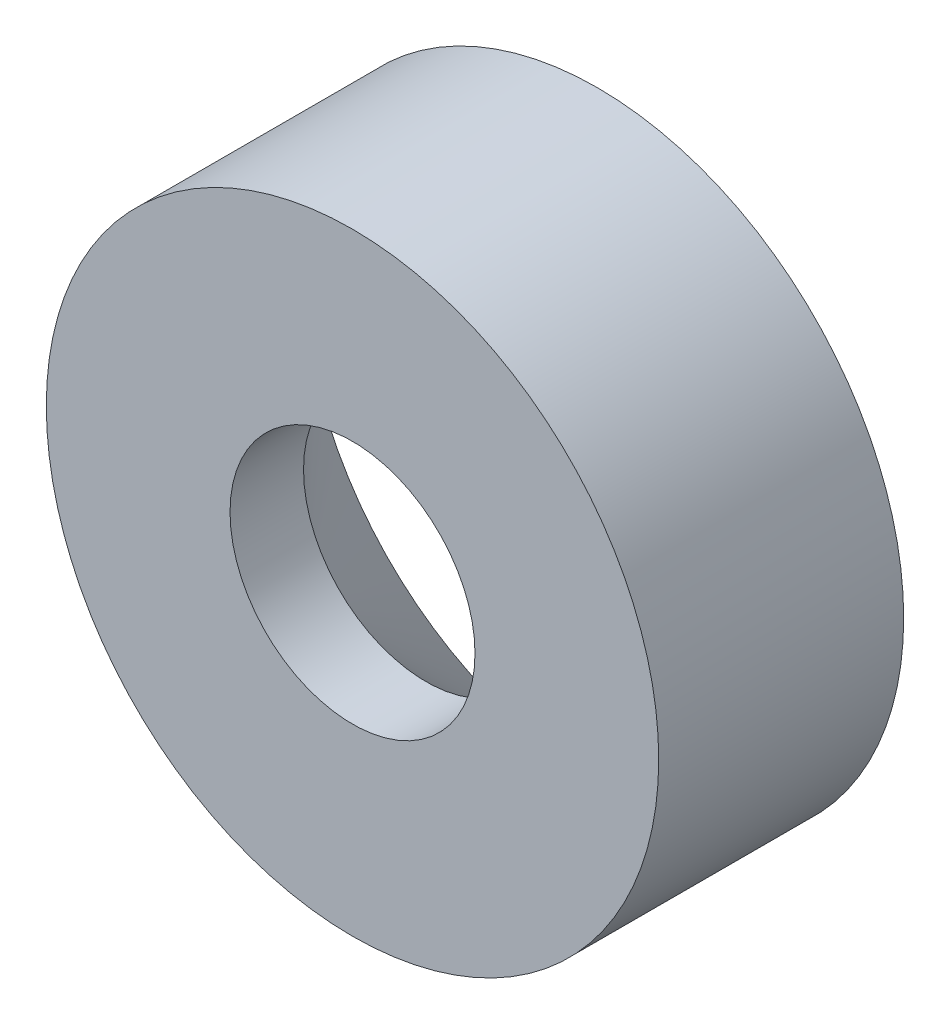
ISO-10303-21;
HEADER;
FILE_DESCRIPTION(('STEP AP214'),'2;1');
FILE_NAME('part.step','',(''),(''),'','','');
FILE_SCHEMA(('AUTOMOTIVE_DESIGN { 1 0 10303 214 1 1 1 1 }'));
ENDSEC;
DATA;
#1=APPLICATION_CONTEXT('core data for automotive mechanical design processes');
#2=APPLICATION_PROTOCOL_DEFINITION('international standard','automotive_design',2000,#1);
#3=PRODUCT_CONTEXT('',#1,'mechanical');
#4=PRODUCT('Part','Part','',(#3));
#5=PRODUCT_RELATED_PRODUCT_CATEGORY('part','',(#4));
#6=PRODUCT_DEFINITION_FORMATION('','',#4);
#7=PRODUCT_DEFINITION_CONTEXT('part definition',#1,'design');
#8=PRODUCT_DEFINITION('design','',#6,#7);
#9=PRODUCT_DEFINITION_SHAPE('','',#8);
#10=(LENGTH_UNIT() NAMED_UNIT(*) SI_UNIT(.MILLI.,.METRE.));
#11=(NAMED_UNIT(*) PLANE_ANGLE_UNIT() SI_UNIT($,.RADIAN.));
#12=(NAMED_UNIT(*) SI_UNIT($,.STERADIAN.) SOLID_ANGLE_UNIT());
#13=UNCERTAINTY_MEASURE_WITH_UNIT(LENGTH_MEASURE(1.E-05),#10,'distance_accuracy_value','');
#14=(GEOMETRIC_REPRESENTATION_CONTEXT(3) GLOBAL_UNCERTAINTY_ASSIGNED_CONTEXT((#13)) GLOBAL_UNIT_ASSIGNED_CONTEXT((#10,
#11,#12)) REPRESENTATION_CONTEXT('',''));
#15=CARTESIAN_POINT('',(0.,0.,0.));
#16=DIRECTION('',(0.,0.,1.));
#17=DIRECTION('',(1.,0.,0.));
#18=AXIS2_PLACEMENT_3D('',#15,#16,#17);
#19=CARTESIAN_POINT('',(0.,0.,10.));
#20=DIRECTION('',(0.,0.,-1.));
#21=DIRECTION('',(-1.,0.,0.));
#22=AXIS2_PLACEMENT_3D('',#19,#20,#21);
#23=CYLINDRICAL_SURFACE('',#22,12.5);
#24=CARTESIAN_POINT('',(0.,0.,10.));
#25=DIRECTION('',(0.,0.,1.));
#26=DIRECTION('',(1.,0.,0.));
#27=AXIS2_PLACEMENT_3D('',#24,#25,#26);
#28=CIRCLE('',#27,12.5);
#29=CARTESIAN_POINT('',(12.5,0.,10.));
#30=VERTEX_POINT('',#29);
#31=EDGE_CURVE('E41',#30,#30,#28,.T.);
#32=ORIENTED_EDGE('',*,*,#31,.F.);
#33=EDGE_LOOP('',(#32));
#34=FACE_BOUND('',#33,.T.);
#35=CARTESIAN_POINT('',(0.,0.,0.));
#36=DIRECTION('',(0.,0.,1.));
#37=DIRECTION('',(1.,0.,0.));
#38=AXIS2_PLACEMENT_3D('',#35,#36,#37);
#39=CIRCLE('',#38,12.5);
#40=CARTESIAN_POINT('',(12.5,0.,0.));
#41=VERTEX_POINT('',#40);
#42=EDGE_CURVE('E45',#41,#41,#39,.T.);
#43=ORIENTED_EDGE('',*,*,#42,.T.);
#44=EDGE_LOOP('',(#43));
#45=FACE_BOUND('',#44,.T.);
#46=ADVANCED_FACE('F30',(#34,#45),#23,.T.);
#47=CARTESIAN_POINT('',(0.,0.,10.));
#48=DIRECTION('',(0.,0.,1.));
#49=DIRECTION('',(1.,0.,0.));
#50=AXIS2_PLACEMENT_3D('',#47,#48,#49);
#51=PLANE('',#50);
#52=CARTESIAN_POINT('',(0.,0.,10.));
#53=DIRECTION('',(0.,0.,-1.));
#54=DIRECTION('',(-1.,0.,0.));
#55=AXIS2_PLACEMENT_3D('',#52,#53,#54);
#56=CIRCLE('',#55,5.);
#57=CARTESIAN_POINT('',(-5.,0.,10.));
#58=VERTEX_POINT('',#57);
#59=EDGE_CURVE('E49',#58,#58,#56,.T.);
#60=ORIENTED_EDGE('',*,*,#59,.T.);
#61=EDGE_LOOP('',(#60));
#62=FACE_BOUND('',#61,.T.);
#63=ORIENTED_EDGE('',*,*,#31,.T.);
#64=EDGE_LOOP('',(#63));
#65=FACE_BOUND('',#64,.T.);
#66=ADVANCED_FACE('F54',(#62,#65),#51,.T.);
#67=CARTESIAN_POINT('',(0.,0.,0.));
#68=DIRECTION('',(0.,0.,1.));
#69=DIRECTION('',(1.,0.,0.));
#70=AXIS2_PLACEMENT_3D('',#67,#68,#69);
#71=PLANE('',#70);
#72=CARTESIAN_POINT('',(0.,0.,0.));
#73=DIRECTION('',(0.,0.,1.));
#74=DIRECTION('',(1.,0.,0.));
#75=AXIS2_PLACEMENT_3D('',#72,#73,#74);
#76=CIRCLE('',#75,12.);
#77=CARTESIAN_POINT('',(12.,0.,0.));
#78=VERTEX_POINT('',#77);
#79=EDGE_CURVE('E10',#78,#78,#76,.T.);
#80=ORIENTED_EDGE('',*,*,#79,.T.);
#81=EDGE_LOOP('',(#80));
#82=FACE_BOUND('',#81,.T.);
#83=ORIENTED_EDGE('',*,*,#42,.F.);
#84=EDGE_LOOP('',(#83));
#85=FACE_BOUND('',#84,.T.);
#86=ADVANCED_FACE('F59',(#82,#85),#71,.F.);
#87=CARTESIAN_POINT('',(0.,0.,10.));
#88=DIRECTION('',(0.,0.,-1.));
#89=DIRECTION('',(-1.,0.,0.));
#90=AXIS2_PLACEMENT_3D('',#87,#88,#89);
#91=CYLINDRICAL_SURFACE('',#90,5.);
#92=CARTESIAN_POINT('',(0.,0.,7.));
#93=DIRECTION('',(0.,0.,1.));
#94=DIRECTION('',(1.,0.,0.));
#95=AXIS2_PLACEMENT_3D('',#92,#93,#94);
#96=CIRCLE('',#95,5.);
#97=CARTESIAN_POINT('',(5.,0.,7.));
#98=VERTEX_POINT('',#97);
#99=EDGE_CURVE('E37',#98,#98,#96,.F.);
#100=ORIENTED_EDGE('',*,*,#99,.T.);
#101=EDGE_LOOP('',(#100));
#102=FACE_BOUND('',#101,.T.);
#103=ORIENTED_EDGE('',*,*,#59,.F.);
#104=EDGE_LOOP('',(#103));
#105=FACE_BOUND('',#104,.T.);
#106=ADVANCED_FACE('F57',(#102,#105),#91,.F.);
#107=CARTESIAN_POINT('',(0.,0.,7.));
#108=DIRECTION('',(0.,0.,-1.));
#109=DIRECTION('',(-1.,0.,0.));
#110=AXIS2_PLACEMENT_3D('',#107,#108,#109);
#111=CONICAL_SURFACE('',#110,5.,0.78539816339745);
#112=ORIENTED_EDGE('',*,*,#79,.F.);
#113=EDGE_LOOP('',(#112));
#114=FACE_BOUND('',#113,.T.);
#115=ORIENTED_EDGE('',*,*,#99,.F.);
#116=EDGE_LOOP('',(#115));
#117=FACE_BOUND('',#116,.T.);
#118=ADVANCED_FACE('F32',(#114,#117),#111,.F.);
#119=CLOSED_SHELL('',(#46,#66,#86,#106,#118));
#120=MANIFOLD_SOLID_BREP('B2',#119);
#121=ADVANCED_BREP_SHAPE_REPRESENTATION('',(#18,#120),#14);
#122=SHAPE_DEFINITION_REPRESENTATION(#9,#121);
ENDSEC;
END-ISO-10303-21;
